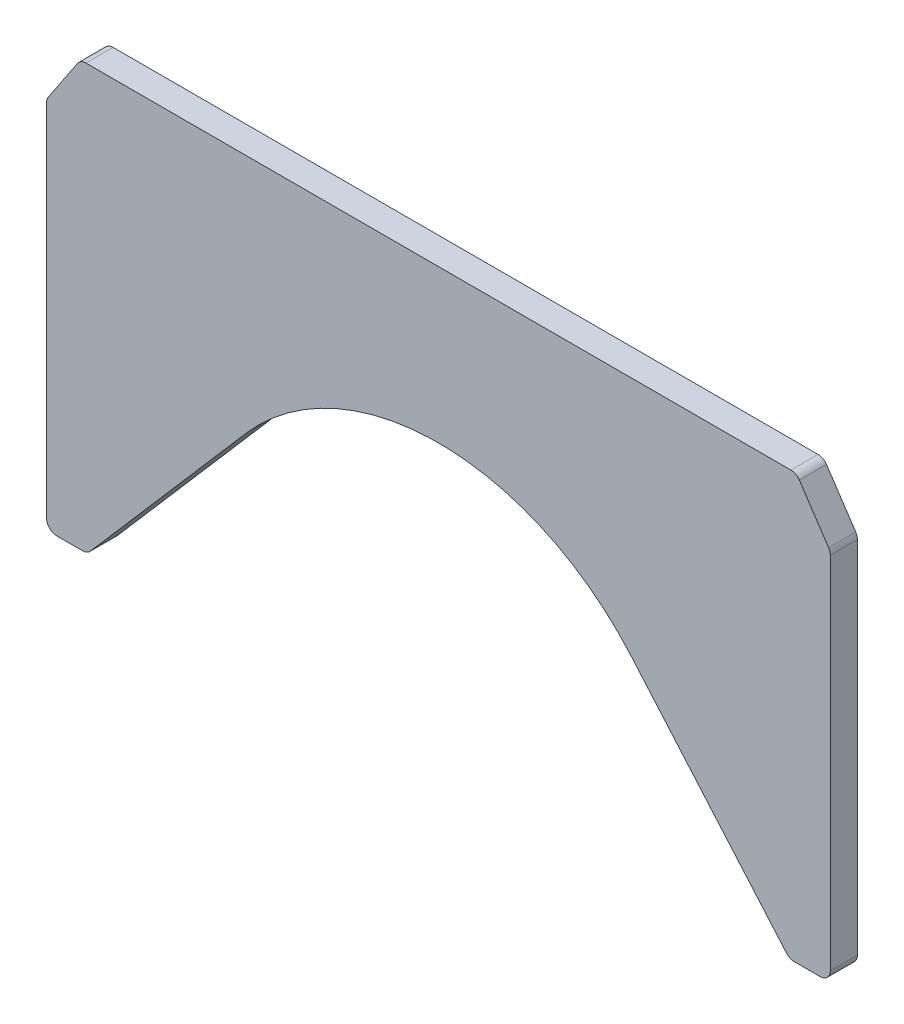
ISO-10303-21;
HEADER;
FILE_DESCRIPTION(('STEP AP214'),'2;1');
FILE_NAME('part.step','',(''),(''),'','','');
FILE_SCHEMA(('AUTOMOTIVE_DESIGN { 1 0 10303 214 1 1 1 1 }'));
ENDSEC;
DATA;
#1=APPLICATION_CONTEXT('core data for automotive mechanical design processes');
#2=APPLICATION_PROTOCOL_DEFINITION('international standard','automotive_design',2000,#1);
#3=PRODUCT_CONTEXT('',#1,'mechanical');
#4=PRODUCT('Part','Part','',(#3));
#5=PRODUCT_RELATED_PRODUCT_CATEGORY('part','',(#4));
#6=PRODUCT_DEFINITION_FORMATION('','',#4);
#7=PRODUCT_DEFINITION_CONTEXT('part definition',#1,'design');
#8=PRODUCT_DEFINITION('design','',#6,#7);
#9=PRODUCT_DEFINITION_SHAPE('','',#8);
#10=(LENGTH_UNIT() NAMED_UNIT(*) SI_UNIT(.MILLI.,.METRE.));
#11=(NAMED_UNIT(*) PLANE_ANGLE_UNIT() SI_UNIT($,.RADIAN.));
#12=(NAMED_UNIT(*) SI_UNIT($,.STERADIAN.) SOLID_ANGLE_UNIT());
#13=UNCERTAINTY_MEASURE_WITH_UNIT(LENGTH_MEASURE(1.E-05),#10,'distance_accuracy_value','');
#14=(GEOMETRIC_REPRESENTATION_CONTEXT(3) GLOBAL_UNCERTAINTY_ASSIGNED_CONTEXT((#13)) GLOBAL_UNIT_ASSIGNED_CONTEXT((#10,
#11,#12)) REPRESENTATION_CONTEXT('',''));
#15=CARTESIAN_POINT('',(0.,0.,0.));
#16=DIRECTION('',(0.,0.,1.));
#17=DIRECTION('',(1.,0.,0.));
#18=AXIS2_PLACEMENT_3D('',#15,#16,#17);
#19=CARTESIAN_POINT('',(2.20931663313005E-13,-120.,7.9999999999999));
#20=DIRECTION('',(0.,0.,-1.));
#21=DIRECTION('',(-1.,0.,0.));
#22=AXIS2_PLACEMENT_3D('',#19,#20,#21);
#23=CYLINDRICAL_SURFACE('',#22,75.);
#24=CARTESIAN_POINT('',(2.21017871854546E-13,-119.999999999999,2.22044604925031E-13));
#25=DIRECTION('',(0.,0.,-1.));
#26=DIRECTION('',(1.,0.,0.));
#27=AXIS2_PLACEMENT_3D('',#24,#25,#26);
#28=CIRCLE('',#27,75.);
#29=CARTESIAN_POINT('',(-56.7184334908846,-70.92842673869,0.));
#30=VERTEX_POINT('',#29);
#31=CARTESIAN_POINT('',(56.7184334908846,-70.9284267386889,1.66533453693773E-13));
#32=VERTEX_POINT('',#31);
#33=EDGE_CURVE('E195',#30,#32,#28,.T.);
#34=ORIENTED_EDGE('',*,*,#33,.T.);
#35=DIRECTION('',(0.,0.,-1.));
#36=VECTOR('',#35,1.);
#37=CARTESIAN_POINT('',(56.7184334908846,-70.9284267386903,8.00000000000034));
#38=LINE('',#37,#36);
#39=CARTESIAN_POINT('',(56.7184334908846,-70.9284267386903,8.00000000000034));
#40=VERTEX_POINT('',#39);
#41=EDGE_CURVE('E11',#40,#32,#38,.T.);
#42=ORIENTED_EDGE('',*,*,#41,.F.);
#43=CARTESIAN_POINT('',(2.20931663313005E-13,-120.,7.9999999999999));
#44=DIRECTION('',(0.,0.,-1.));
#45=DIRECTION('',(1.,0.,0.));
#46=AXIS2_PLACEMENT_3D('',#43,#44,#45);
#47=CIRCLE('',#46,75.);
#48=CARTESIAN_POINT('',(-56.7184334908846,-70.9284267386905,8.00000000000028));
#49=VERTEX_POINT('',#48);
#50=EDGE_CURVE('E229',#49,#40,#47,.T.);
#51=ORIENTED_EDGE('',*,*,#50,.F.);
#52=DIRECTION('',(0.,0.,-1.));
#53=VECTOR('',#52,1.);
#54=CARTESIAN_POINT('',(-56.7184334908846,-70.9284267386905,8.00000000000028));
#55=LINE('',#54,#53);
#56=EDGE_CURVE('E191',#49,#30,#55,.T.);
#57=ORIENTED_EDGE('',*,*,#56,.T.);
#58=EDGE_LOOP('',(#34,#42,#51,#57));
#59=FACE_BOUND('',#58,.T.);
#60=ADVANCED_FACE('F39',(#59),#23,.F.);
#61=CARTESIAN_POINT('',(102.602691231793,-123.962862930452,8.00000000000001));
#62=DIRECTION('',(0.756245779878461,0.654287643484132,0.));
#63=DIRECTION('',(-0.654287643484132,0.756245779878461,0.));
#64=AXIS2_PLACEMENT_3D('',#61,#62,#63);
#65=PLANE('',#64);
#66=DIRECTION('',(0.654287643484132,-0.756245779878461,0.));
#67=VECTOR('',#66,1.);
#68=CARTESIAN_POINT('',(102.602691231793,-123.962862930452,-1.66533453693773E-13));
#69=LINE('',#68,#67);
#70=CARTESIAN_POINT('',(102.602691231793,-123.962862930452,-1.66533453693773E-13));
#71=VERTEX_POINT('',#70);
#72=EDGE_CURVE('E198',#32,#71,#69,.T.);
#73=ORIENTED_EDGE('',*,*,#72,.T.);
#74=DIRECTION('',(0.,0.,-1.));
#75=VECTOR('',#74,1.);
#76=CARTESIAN_POINT('',(102.602691231793,-123.962862930452,8.00000000000001));
#77=LINE('',#76,#75);
#78=CARTESIAN_POINT('',(102.602691231793,-123.962862930452,8.00000000000001));
#79=VERTEX_POINT('',#78);
#80=EDGE_CURVE('E47',#79,#71,#77,.T.);
#81=ORIENTED_EDGE('',*,*,#80,.F.);
#82=DIRECTION('',(0.654287643484132,-0.756245779878461,0.));
#83=VECTOR('',#82,1.);
#84=CARTESIAN_POINT('',(102.602691231793,-123.962862930452,8.00000000000001));
#85=LINE('',#84,#83);
#86=EDGE_CURVE('E128',#40,#79,#85,.T.);
#87=ORIENTED_EDGE('',*,*,#86,.F.);
#88=ORIENTED_EDGE('',*,*,#41,.T.);
#89=EDGE_LOOP('',(#73,#81,#87,#88));
#90=FACE_BOUND('',#89,.T.);
#91=ADVANCED_FACE('F337',(#90),#65,.F.);
#92=CARTESIAN_POINT('',(104.871428571428,-122.,8.00000000000017));
#93=DIRECTION('',(0.,0.,-1.));
#94=DIRECTION('',(-1.,0.,0.));
#95=AXIS2_PLACEMENT_3D('',#92,#93,#94);
#96=CYLINDRICAL_SURFACE('',#95,3.00000000000001);
#97=CARTESIAN_POINT('',(104.871428571428,-122.,0.));
#98=DIRECTION('',(0.,0.,1.));
#99=DIRECTION('',(-1.,0.,0.));
#100=AXIS2_PLACEMENT_3D('',#97,#98,#99);
#101=CIRCLE('',#100,3.00000000000001);
#102=CARTESIAN_POINT('',(104.871428571428,-125.000000000001,0.));
#103=VERTEX_POINT('',#102);
#104=EDGE_CURVE('E200',#71,#103,#101,.T.);
#105=ORIENTED_EDGE('',*,*,#104,.T.);
#106=DIRECTION('',(0.,0.,-1.));
#107=VECTOR('',#106,1.);
#108=CARTESIAN_POINT('',(104.871428571428,-125.,8.00000000000001));
#109=LINE('',#108,#107);
#110=CARTESIAN_POINT('',(104.871428571428,-125.,8.00000000000001));
#111=VERTEX_POINT('',#110);
#112=EDGE_CURVE('E266',#111,#103,#109,.T.);
#113=ORIENTED_EDGE('',*,*,#112,.F.);
#114=CARTESIAN_POINT('',(104.871428571428,-122.,8.00000000000017));
#115=DIRECTION('',(0.,0.,1.));
#116=DIRECTION('',(-1.,0.,0.));
#117=AXIS2_PLACEMENT_3D('',#114,#115,#116);
#118=CIRCLE('',#117,3.00000000000001);
#119=EDGE_CURVE('E274',#79,#111,#118,.T.);
#120=ORIENTED_EDGE('',*,*,#119,.F.);
#121=ORIENTED_EDGE('',*,*,#80,.T.);
#122=EDGE_LOOP('',(#105,#113,#120,#121));
#123=FACE_BOUND('',#122,.T.);
#124=ADVANCED_FACE('F272',(#123),#96,.T.);
#125=CARTESIAN_POINT('',(112.5,-125.,8.00000000000001));
#126=DIRECTION('',(0.,1.,0.));
#127=DIRECTION('',(-1.,0.,0.));
#128=AXIS2_PLACEMENT_3D('',#125,#126,#127);
#129=PLANE('',#128);
#130=DIRECTION('',(1.,0.,0.));
#131=VECTOR('',#130,1.);
#132=CARTESIAN_POINT('',(112.5,-125.,2.22044604925031E-13));
#133=LINE('',#132,#131);
#134=CARTESIAN_POINT('',(112.5,-125.,2.22044604925031E-13));
#135=VERTEX_POINT('',#134);
#136=EDGE_CURVE('E202',#103,#135,#133,.T.);
#137=ORIENTED_EDGE('',*,*,#136,.T.);
#138=DIRECTION('',(0.,0.,-1.));
#139=VECTOR('',#138,1.);
#140=CARTESIAN_POINT('',(112.5,-125.,8.00000000000001));
#141=LINE('',#140,#139);
#142=CARTESIAN_POINT('',(112.5,-125.,8.00000000000001));
#143=VERTEX_POINT('',#142);
#144=EDGE_CURVE('E263',#143,#135,#141,.T.);
#145=ORIENTED_EDGE('',*,*,#144,.F.);
#146=DIRECTION('',(1.,0.,0.));
#147=VECTOR('',#146,1.);
#148=CARTESIAN_POINT('',(112.5,-125.,8.00000000000001));
#149=LINE('',#148,#147);
#150=EDGE_CURVE('E292',#111,#143,#149,.T.);
#151=ORIENTED_EDGE('',*,*,#150,.F.);
#152=ORIENTED_EDGE('',*,*,#112,.T.);
#153=EDGE_LOOP('',(#137,#145,#151,#152));
#154=FACE_BOUND('',#153,.T.);
#155=ADVANCED_FACE('F283',(#154),#129,.F.);
#156=CARTESIAN_POINT('',(112.5,-122.,8.0000000000004));
#157=DIRECTION('',(0.,0.,-1.));
#158=DIRECTION('',(-1.,0.,0.));
#159=AXIS2_PLACEMENT_3D('',#156,#157,#158);
#160=CYLINDRICAL_SURFACE('',#159,2.99999999999999);
#161=CARTESIAN_POINT('',(112.5,-122.,-1.11022302462516E-13));
#162=DIRECTION('',(0.,0.,1.));
#163=DIRECTION('',(-1.,0.,0.));
#164=AXIS2_PLACEMENT_3D('',#161,#162,#163);
#165=CIRCLE('',#164,2.99999999999999);
#166=CARTESIAN_POINT('',(115.5,-122.,0.));
#167=VERTEX_POINT('',#166);
#168=EDGE_CURVE('E204',#135,#167,#165,.T.);
#169=ORIENTED_EDGE('',*,*,#168,.T.);
#170=DIRECTION('',(0.,0.,-1.));
#171=VECTOR('',#170,1.);
#172=CARTESIAN_POINT('',(115.5,-122.,8.0000000000004));
#173=LINE('',#172,#171);
#174=CARTESIAN_POINT('',(115.5,-122.,8.0000000000004));
#175=VERTEX_POINT('',#174);
#176=EDGE_CURVE('E260',#175,#167,#173,.T.);
#177=ORIENTED_EDGE('',*,*,#176,.F.);
#178=CARTESIAN_POINT('',(112.5,-122.,8.0000000000004));
#179=DIRECTION('',(0.,0.,1.));
#180=DIRECTION('',(-1.,0.,0.));
#181=AXIS2_PLACEMENT_3D('',#178,#179,#180);
#182=CIRCLE('',#181,2.99999999999999);
#183=EDGE_CURVE('E289',#143,#175,#182,.T.);
#184=ORIENTED_EDGE('',*,*,#183,.F.);
#185=ORIENTED_EDGE('',*,*,#144,.T.);
#186=EDGE_LOOP('',(#169,#177,#184,#185));
#187=FACE_BOUND('',#186,.T.);
#188=ADVANCED_FACE('F287',(#187),#160,.T.);
#189=CARTESIAN_POINT('',(115.5,-15.908326913195,8.00000000000034));
#190=DIRECTION('',(-1.,0.,0.));
#191=DIRECTION('',(0.,-1.,0.));
#192=AXIS2_PLACEMENT_3D('',#189,#190,#191);
#193=PLANE('',#192);
#194=DIRECTION('',(0.,1.,0.));
#195=VECTOR('',#194,1.);
#196=CARTESIAN_POINT('',(115.5,-15.9083269131961,0.));
#197=LINE('',#196,#195);
#198=CARTESIAN_POINT('',(115.5,-15.9083269131961,0.));
#199=VERTEX_POINT('',#198);
#200=EDGE_CURVE('E206',#167,#199,#197,.T.);
#201=ORIENTED_EDGE('',*,*,#200,.T.);
#202=DIRECTION('',(0.,0.,-1.));
#203=VECTOR('',#202,1.);
#204=CARTESIAN_POINT('',(115.5,-15.908326913195,8.00000000000034));
#205=LINE('',#204,#203);
#206=CARTESIAN_POINT('',(115.5,-15.908326913195,8.00000000000034));
#207=VERTEX_POINT('',#206);
#208=EDGE_CURVE('E257',#207,#199,#205,.T.);
#209=ORIENTED_EDGE('',*,*,#208,.F.);
#210=DIRECTION('',(0.,1.,0.));
#211=VECTOR('',#210,1.);
#212=CARTESIAN_POINT('',(115.5,-15.908326913195,8.00000000000034));
#213=LINE('',#212,#211);
#214=EDGE_CURVE('E291',#175,#207,#213,.T.);
#215=ORIENTED_EDGE('',*,*,#214,.F.);
#216=ORIENTED_EDGE('',*,*,#176,.T.);
#217=EDGE_LOOP('',(#201,#209,#215,#216));
#218=FACE_BOUND('',#217,.T.);
#219=ADVANCED_FACE('F350',(#218),#193,.F.);
#220=CARTESIAN_POINT('',(112.5,-15.9083269131957,8.00000000000023));
#221=DIRECTION('',(0.,0.,-1.));
#222=DIRECTION('',(-1.,0.,0.));
#223=AXIS2_PLACEMENT_3D('',#220,#221,#222);
#224=CYLINDRICAL_SURFACE('',#223,3.00000000000001);
#225=CARTESIAN_POINT('',(112.5,-15.9083269131961,2.22044604925031E-13));
#226=DIRECTION('',(0.,0.,1.));
#227=DIRECTION('',(-1.,0.,0.));
#228=AXIS2_PLACEMENT_3D('',#225,#226,#227);
#229=CIRCLE('',#228,3.00000000000001);
#230=CARTESIAN_POINT('',(114.996150883013,-14.2442263245204,0.));
#231=VERTEX_POINT('',#230);
#232=EDGE_CURVE('E208',#199,#231,#229,.T.);
#233=ORIENTED_EDGE('',*,*,#232,.T.);
#234=DIRECTION('',(0.,0.,-1.));
#235=VECTOR('',#234,1.);
#236=CARTESIAN_POINT('',(114.996150883013,-14.2442263245197,8.0000000000004));
#237=LINE('',#236,#235);
#238=CARTESIAN_POINT('',(114.996150883013,-14.2442263245197,8.0000000000004));
#239=VERTEX_POINT('',#238);
#240=EDGE_CURVE('E254',#239,#231,#237,.T.);
#241=ORIENTED_EDGE('',*,*,#240,.F.);
#242=CARTESIAN_POINT('',(112.5,-15.9083269131957,8.00000000000023));
#243=DIRECTION('',(0.,0.,1.));
#244=DIRECTION('',(-1.,0.,0.));
#245=AXIS2_PLACEMENT_3D('',#242,#243,#244);
#246=CIRCLE('',#245,3.00000000000001);
#247=EDGE_CURVE('E294',#207,#239,#246,.T.);
#248=ORIENTED_EDGE('',*,*,#247,.F.);
#249=ORIENTED_EDGE('',*,*,#208,.T.);
#250=EDGE_LOOP('',(#233,#241,#248,#249));
#251=FACE_BOUND('',#250,.T.);
#252=ADVANCED_FACE('F353',(#251),#224,.T.);
#253=CARTESIAN_POINT('',(106.39059960755,-1.33589941132328,8.00000000000023));
#254=DIRECTION('',(-0.832050294337845,-0.554700196225227,0.));
#255=DIRECTION('',(0.554700196225227,-0.832050294337845,0.));
#256=AXIS2_PLACEMENT_3D('',#253,#254,#255);
#257=PLANE('',#256);
#258=DIRECTION('',(-0.554700196225227,0.832050294337845,0.));
#259=VECTOR('',#258,1.);
#260=CARTESIAN_POINT('',(106.39059960755,-1.33589941132439,1.11022302462516E-13));
#261=LINE('',#260,#259);
#262=CARTESIAN_POINT('',(106.39059960755,-1.33589941132439,1.11022302462516E-13));
#263=VERTEX_POINT('',#262);
#264=EDGE_CURVE('E210',#231,#263,#261,.T.);
#265=ORIENTED_EDGE('',*,*,#264,.T.);
#266=DIRECTION('',(0.,0.,-1.));
#267=VECTOR('',#266,1.);
#268=CARTESIAN_POINT('',(106.39059960755,-1.33589941132328,8.00000000000023));
#269=LINE('',#268,#267);
#270=CARTESIAN_POINT('',(106.39059960755,-1.33589941132328,8.00000000000023));
#271=VERTEX_POINT('',#270);
#272=EDGE_CURVE('E251',#271,#263,#269,.T.);
#273=ORIENTED_EDGE('',*,*,#272,.F.);
#274=DIRECTION('',(-0.554700196225227,0.832050294337845,0.));
#275=VECTOR('',#274,1.);
#276=CARTESIAN_POINT('',(106.39059960755,-1.33589941132328,8.00000000000023));
#277=LINE('',#276,#275);
#278=EDGE_CURVE('E300',#239,#271,#277,.T.);
#279=ORIENTED_EDGE('',*,*,#278,.F.);
#280=ORIENTED_EDGE('',*,*,#240,.T.);
#281=EDGE_LOOP('',(#265,#273,#279,#280));
#282=FACE_BOUND('',#281,.T.);
#283=ADVANCED_FACE('F357',(#282),#257,.F.);
#284=CARTESIAN_POINT('',(103.894448724536,-2.99999999999989,8.00000000000001));
#285=DIRECTION('',(0.,0.,-1.));
#286=DIRECTION('',(-1.,0.,0.));
#287=AXIS2_PLACEMENT_3D('',#284,#285,#286);
#288=CYLINDRICAL_SURFACE('',#287,3.00000000000001);
#289=CARTESIAN_POINT('',(103.894448724536,-3.00000000000011,0.));
#290=DIRECTION('',(0.,0.,1.));
#291=DIRECTION('',(-1.,0.,0.));
#292=AXIS2_PLACEMENT_3D('',#289,#290,#291);
#293=CIRCLE('',#292,3.00000000000001);
#294=CARTESIAN_POINT('',(103.894448724536,2.22044604925031E-13,2.77555756156289E-13));
#295=VERTEX_POINT('',#294);
#296=EDGE_CURVE('E212',#263,#295,#293,.T.);
#297=ORIENTED_EDGE('',*,*,#296,.T.);
#298=DIRECTION('',(0.,0.,-1.));
#299=VECTOR('',#298,1.);
#300=CARTESIAN_POINT('',(103.894448724536,0.,8.00000000000001));
#301=LINE('',#300,#299);
#302=CARTESIAN_POINT('',(103.894448724536,0.,8.00000000000001));
#303=VERTEX_POINT('',#302);
#304=EDGE_CURVE('E248',#303,#295,#301,.T.);
#305=ORIENTED_EDGE('',*,*,#304,.F.);
#306=CARTESIAN_POINT('',(103.894448724536,-2.99999999999989,8.00000000000001));
#307=DIRECTION('',(0.,0.,1.));
#308=DIRECTION('',(-1.,0.,0.));
#309=AXIS2_PLACEMENT_3D('',#306,#307,#308);
#310=CIRCLE('',#309,3.00000000000001);
#311=EDGE_CURVE('E302',#271,#303,#310,.T.);
#312=ORIENTED_EDGE('',*,*,#311,.F.);
#313=ORIENTED_EDGE('',*,*,#272,.T.);
#314=EDGE_LOOP('',(#297,#305,#312,#313));
#315=FACE_BOUND('',#314,.T.);
#316=ADVANCED_FACE('F361',(#315),#288,.T.);
#317=CARTESIAN_POINT('',(-103.894448724536,0.,8.00000000000028));
#318=DIRECTION('',(0.,-1.,0.));
#319=DIRECTION('',(1.,0.,0.));
#320=AXIS2_PLACEMENT_3D('',#317,#318,#319);
#321=PLANE('',#320);
#322=DIRECTION('',(-1.,0.,0.));
#323=VECTOR('',#322,1.);
#324=CARTESIAN_POINT('',(-103.894448724536,0.,2.22044604925031E-13));
#325=LINE('',#324,#323);
#326=CARTESIAN_POINT('',(-103.894448724536,0.,2.22044604925031E-13));
#327=VERTEX_POINT('',#326);
#328=EDGE_CURVE('E214',#295,#327,#325,.T.);
#329=ORIENTED_EDGE('',*,*,#328,.T.);
#330=DIRECTION('',(0.,0.,-1.));
#331=VECTOR('',#330,1.);
#332=CARTESIAN_POINT('',(-103.894448724536,0.,8.00000000000028));
#333=LINE('',#332,#331);
#334=CARTESIAN_POINT('',(-103.894448724536,0.,8.00000000000028));
#335=VERTEX_POINT('',#334);
#336=EDGE_CURVE('E245',#335,#327,#333,.T.);
#337=ORIENTED_EDGE('',*,*,#336,.F.);
#338=DIRECTION('',(-1.,0.,0.));
#339=VECTOR('',#338,1.);
#340=CARTESIAN_POINT('',(-103.894448724536,0.,8.00000000000028));
#341=LINE('',#340,#339);
#342=EDGE_CURVE('E304',#303,#335,#341,.T.);
#343=ORIENTED_EDGE('',*,*,#342,.F.);
#344=ORIENTED_EDGE('',*,*,#304,.T.);
#345=EDGE_LOOP('',(#329,#337,#343,#344));
#346=FACE_BOUND('',#345,.T.);
#347=ADVANCED_FACE('F365',(#346),#321,.F.);
#348=CARTESIAN_POINT('',(-103.894448724536,-2.99999999999989,8.00000000000023));
#349=DIRECTION('',(0.,0.,-1.));
#350=DIRECTION('',(-1.,0.,0.));
#351=AXIS2_PLACEMENT_3D('',#348,#349,#350);
#352=CYLINDRICAL_SURFACE('',#351,3.00000000000001);
#353=CARTESIAN_POINT('',(-103.894448724536,-3.000000000001,-2.22044604925031E-13));
#354=DIRECTION('',(0.,0.,1.));
#355=DIRECTION('',(-1.,0.,0.));
#356=AXIS2_PLACEMENT_3D('',#353,#354,#355);
#357=CIRCLE('',#356,3.00000000000001);
#358=CARTESIAN_POINT('',(-106.39059960755,-1.33589941132439,1.11022302462516E-13));
#359=VERTEX_POINT('',#358);
#360=EDGE_CURVE('E216',#327,#359,#357,.T.);
#361=ORIENTED_EDGE('',*,*,#360,.T.);
#362=DIRECTION('',(0.,0.,-1.));
#363=VECTOR('',#362,1.);
#364=CARTESIAN_POINT('',(-106.39059960755,-1.33589941132417,7.99999999999984));
#365=LINE('',#364,#363);
#366=CARTESIAN_POINT('',(-106.39059960755,-1.33589941132417,7.99999999999984));
#367=VERTEX_POINT('',#366);
#368=EDGE_CURVE('E242',#367,#359,#365,.T.);
#369=ORIENTED_EDGE('',*,*,#368,.F.);
#370=CARTESIAN_POINT('',(-103.894448724536,-2.99999999999989,8.00000000000023));
#371=DIRECTION('',(0.,0.,1.));
#372=DIRECTION('',(-1.,0.,0.));
#373=AXIS2_PLACEMENT_3D('',#370,#371,#372);
#374=CIRCLE('',#373,3.00000000000001);
#375=EDGE_CURVE('E306',#335,#367,#374,.T.);
#376=ORIENTED_EDGE('',*,*,#375,.F.);
#377=ORIENTED_EDGE('',*,*,#336,.T.);
#378=EDGE_LOOP('',(#361,#369,#376,#377));
#379=FACE_BOUND('',#378,.T.);
#380=ADVANCED_FACE('F369',(#379),#352,.T.);
#381=CARTESIAN_POINT('',(-106.39059960755,-1.33589941132417,7.99999999999984));
#382=DIRECTION('',(0.832050294337845,-0.554700196225227,0.));
#383=DIRECTION('',(0.554700196225227,0.832050294337845,0.));
#384=AXIS2_PLACEMENT_3D('',#381,#382,#383);
#385=PLANE('',#384);
#386=DIRECTION('',(-0.554700196225227,-0.832050294337845,0.));
#387=VECTOR('',#386,1.);
#388=CARTESIAN_POINT('',(-106.39059960755,-1.33589941132439,1.11022302462516E-13));
#389=LINE('',#388,#387);
#390=CARTESIAN_POINT('',(-114.996150883014,-14.2442263245204,2.22044604925031E-13));
#391=VERTEX_POINT('',#390);
#392=EDGE_CURVE('E218',#359,#391,#389,.T.);
#393=ORIENTED_EDGE('',*,*,#392,.T.);
#394=DIRECTION('',(0.,0.,-1.));
#395=VECTOR('',#394,1.);
#396=CARTESIAN_POINT('',(-114.996150883014,-14.2442263245197,8.0000000000004));
#397=LINE('',#396,#395);
#398=CARTESIAN_POINT('',(-114.996150883014,-14.2442263245197,8.0000000000004));
#399=VERTEX_POINT('',#398);
#400=EDGE_CURVE('E239',#399,#391,#397,.T.);
#401=ORIENTED_EDGE('',*,*,#400,.F.);
#402=DIRECTION('',(-0.554700196225227,-0.832050294337845,0.));
#403=VECTOR('',#402,1.);
#404=CARTESIAN_POINT('',(-106.39059960755,-1.33589941132417,7.99999999999984));
#405=LINE('',#404,#403);
#406=EDGE_CURVE('E308',#367,#399,#405,.T.);
#407=ORIENTED_EDGE('',*,*,#406,.F.);
#408=ORIENTED_EDGE('',*,*,#368,.T.);
#409=EDGE_LOOP('',(#393,#401,#407,#408));
#410=FACE_BOUND('',#409,.T.);
#411=ADVANCED_FACE('F373',(#410),#385,.F.);
#412=CARTESIAN_POINT('',(-112.5,-15.9083269131952,8.00000000000028));
#413=DIRECTION('',(0.,0.,-1.));
#414=DIRECTION('',(-1.,0.,0.));
#415=AXIS2_PLACEMENT_3D('',#412,#413,#414);
#416=CYLINDRICAL_SURFACE('',#415,3.00000000000001);
#417=CARTESIAN_POINT('',(-112.5,-15.9083269131961,0.));
#418=DIRECTION('',(0.,0.,1.));
#419=DIRECTION('',(-1.,0.,0.));
#420=AXIS2_PLACEMENT_3D('',#417,#418,#419);
#421=CIRCLE('',#420,3.00000000000001);
#422=CARTESIAN_POINT('',(-115.5,-15.9083269131961,0.));
#423=VERTEX_POINT('',#422);
#424=EDGE_CURVE('E220',#391,#423,#421,.T.);
#425=ORIENTED_EDGE('',*,*,#424,.T.);
#426=DIRECTION('',(0.,0.,-1.));
#427=VECTOR('',#426,1.);
#428=CARTESIAN_POINT('',(-115.5,-15.9083269131954,8.00000000000028));
#429=LINE('',#428,#427);
#430=CARTESIAN_POINT('',(-115.5,-15.9083269131954,8.00000000000028));
#431=VERTEX_POINT('',#430);
#432=EDGE_CURVE('E236',#431,#423,#429,.T.);
#433=ORIENTED_EDGE('',*,*,#432,.F.);
#434=CARTESIAN_POINT('',(-112.5,-15.9083269131952,8.00000000000028));
#435=DIRECTION('',(0.,0.,1.));
#436=DIRECTION('',(-1.,0.,0.));
#437=AXIS2_PLACEMENT_3D('',#434,#435,#436);
#438=CIRCLE('',#437,3.00000000000001);
#439=EDGE_CURVE('E310',#399,#431,#438,.T.);
#440=ORIENTED_EDGE('',*,*,#439,.F.);
#441=ORIENTED_EDGE('',*,*,#400,.T.);
#442=EDGE_LOOP('',(#425,#433,#440,#441));
#443=FACE_BOUND('',#442,.T.);
#444=ADVANCED_FACE('F377',(#443),#416,.T.);
#445=CARTESIAN_POINT('',(-115.5,-15.9083269131954,8.00000000000028));
#446=DIRECTION('',(1.,0.,0.));
#447=DIRECTION('',(0.,1.,0.));
#448=AXIS2_PLACEMENT_3D('',#445,#446,#447);
#449=PLANE('',#448);
#450=DIRECTION('',(0.,-1.,0.));
#451=VECTOR('',#450,1.);
#452=CARTESIAN_POINT('',(-115.5,-15.9083269131961,0.));
#453=LINE('',#452,#451);
#454=CARTESIAN_POINT('',(-115.5,-122.000000000001,0.));
#455=VERTEX_POINT('',#454);
#456=EDGE_CURVE('E222',#423,#455,#453,.T.);
#457=ORIENTED_EDGE('',*,*,#456,.T.);
#458=DIRECTION('',(0.,0.,-1.));
#459=VECTOR('',#458,1.);
#460=CARTESIAN_POINT('',(-115.5,-122.,8.00000000000017));
#461=LINE('',#460,#459);
#462=CARTESIAN_POINT('',(-115.5,-122.,8.00000000000017));
#463=VERTEX_POINT('',#462);
#464=EDGE_CURVE('E233',#463,#455,#461,.T.);
#465=ORIENTED_EDGE('',*,*,#464,.F.);
#466=DIRECTION('',(0.,-1.,0.));
#467=VECTOR('',#466,1.);
#468=CARTESIAN_POINT('',(-115.5,-15.9083269131954,8.00000000000028));
#469=LINE('',#468,#467);
#470=EDGE_CURVE('E312',#431,#463,#469,.T.);
#471=ORIENTED_EDGE('',*,*,#470,.F.);
#472=ORIENTED_EDGE('',*,*,#432,.T.);
#473=EDGE_LOOP('',(#457,#465,#471,#472));
#474=FACE_BOUND('',#473,.T.);
#475=ADVANCED_FACE('F318',(#474),#449,.F.);
#476=CARTESIAN_POINT('',(-112.5,-122.,8.00000000000028));
#477=DIRECTION('',(0.,0.,-1.));
#478=DIRECTION('',(-1.,0.,0.));
#479=AXIS2_PLACEMENT_3D('',#476,#477,#478);
#480=CYLINDRICAL_SURFACE('',#479,2.99999999999999);
#481=CARTESIAN_POINT('',(-112.5,-122.,0.));
#482=DIRECTION('',(0.,0.,1.));
#483=DIRECTION('',(-1.,0.,0.));
#484=AXIS2_PLACEMENT_3D('',#481,#482,#483);
#485=CIRCLE('',#484,2.99999999999999);
#486=CARTESIAN_POINT('',(-112.5,-125.000000000001,0.));
#487=VERTEX_POINT('',#486);
#488=EDGE_CURVE('E224',#455,#487,#485,.T.);
#489=ORIENTED_EDGE('',*,*,#488,.T.);
#490=DIRECTION('',(0.,0.,-1.));
#491=VECTOR('',#490,1.);
#492=CARTESIAN_POINT('',(-112.5,-125.,7.99999999999979));
#493=LINE('',#492,#491);
#494=CARTESIAN_POINT('',(-112.5,-125.,7.99999999999979));
#495=VERTEX_POINT('',#494);
#496=EDGE_CURVE('E186',#495,#487,#493,.T.);
#497=ORIENTED_EDGE('',*,*,#496,.F.);
#498=CARTESIAN_POINT('',(-112.5,-122.,8.00000000000028));
#499=DIRECTION('',(0.,0.,1.));
#500=DIRECTION('',(-1.,0.,0.));
#501=AXIS2_PLACEMENT_3D('',#498,#499,#500);
#502=CIRCLE('',#501,2.99999999999999);
#503=EDGE_CURVE('E177',#463,#495,#502,.T.);
#504=ORIENTED_EDGE('',*,*,#503,.F.);
#505=ORIENTED_EDGE('',*,*,#464,.T.);
#506=EDGE_LOOP('',(#489,#497,#504,#505));
#507=FACE_BOUND('',#506,.T.);
#508=ADVANCED_FACE('F322',(#507),#480,.T.);
#509=CARTESIAN_POINT('',(-112.5,-125.,7.99999999999979));
#510=DIRECTION('',(0.,1.,0.));
#511=DIRECTION('',(-1.,0.,0.));
#512=AXIS2_PLACEMENT_3D('',#509,#510,#511);
#513=PLANE('',#512);
#514=DIRECTION('',(1.,0.,0.));
#515=VECTOR('',#514,1.);
#516=CARTESIAN_POINT('',(-112.5,-125.000000000001,0.));
#517=LINE('',#516,#515);
#518=CARTESIAN_POINT('',(-104.871428571429,-125.000000000001,-2.77555756156289E-13));
#519=VERTEX_POINT('',#518);
#520=EDGE_CURVE('E185',#487,#519,#517,.T.);
#521=ORIENTED_EDGE('',*,*,#520,.T.);
#522=DIRECTION('',(0.,0.,-1.));
#523=VECTOR('',#522,1.);
#524=CARTESIAN_POINT('',(-104.871428571429,-125.,7.99999999999979));
#525=LINE('',#524,#523);
#526=CARTESIAN_POINT('',(-104.871428571429,-125.,7.99999999999979));
#527=VERTEX_POINT('',#526);
#528=EDGE_CURVE('E182',#527,#519,#525,.T.);
#529=ORIENTED_EDGE('',*,*,#528,.F.);
#530=DIRECTION('',(1.,0.,0.));
#531=VECTOR('',#530,1.);
#532=CARTESIAN_POINT('',(-112.5,-125.,7.99999999999979));
#533=LINE('',#532,#531);
#534=EDGE_CURVE('E171',#495,#527,#533,.T.);
#535=ORIENTED_EDGE('',*,*,#534,.F.);
#536=ORIENTED_EDGE('',*,*,#496,.T.);
#537=EDGE_LOOP('',(#521,#529,#535,#536));
#538=FACE_BOUND('',#537,.T.);
#539=ADVANCED_FACE('F183',(#538),#513,.F.);
#540=CARTESIAN_POINT('',(-104.871428571429,-122.,8.00000000000028));
#541=DIRECTION('',(0.,0.,-1.));
#542=DIRECTION('',(-1.,0.,0.));
#543=AXIS2_PLACEMENT_3D('',#540,#541,#542);
#544=CYLINDRICAL_SURFACE('',#543,3.00000000000001);
#545=CARTESIAN_POINT('',(-104.871428571429,-122.000000000001,1.11022302462516E-13));
#546=DIRECTION('',(0.,0.,1.));
#547=DIRECTION('',(-1.,0.,0.));
#548=AXIS2_PLACEMENT_3D('',#545,#546,#547);
#549=CIRCLE('',#548,3.00000000000001);
#550=CARTESIAN_POINT('',(-102.602691231793,-123.962862930452,-1.11022302462516E-13));
#551=VERTEX_POINT('',#550);
#552=EDGE_CURVE('E114',#519,#551,#549,.T.);
#553=ORIENTED_EDGE('',*,*,#552,.T.);
#554=DIRECTION('',(0.,0.,-1.));
#555=VECTOR('',#554,1.);
#556=CARTESIAN_POINT('',(-102.602691231793,-123.962862930453,7.99999999999995));
#557=LINE('',#556,#555);
#558=CARTESIAN_POINT('',(-102.602691231793,-123.962862930453,7.99999999999995));
#559=VERTEX_POINT('',#558);
#560=EDGE_CURVE('E187',#559,#551,#557,.T.);
#561=ORIENTED_EDGE('',*,*,#560,.F.);
#562=CARTESIAN_POINT('',(-104.871428571429,-122.,8.00000000000028));
#563=DIRECTION('',(0.,0.,1.));
#564=DIRECTION('',(-1.,0.,0.));
#565=AXIS2_PLACEMENT_3D('',#562,#563,#564);
#566=CIRCLE('',#565,3.00000000000001);
#567=EDGE_CURVE('E175',#527,#559,#566,.T.);
#568=ORIENTED_EDGE('',*,*,#567,.F.);
#569=ORIENTED_EDGE('',*,*,#528,.T.);
#570=EDGE_LOOP('',(#553,#561,#568,#569));
#571=FACE_BOUND('',#570,.T.);
#572=ADVANCED_FACE('F189',(#571),#544,.T.);
#573=CARTESIAN_POINT('',(-102.602691231793,-123.962862930453,7.99999999999995));
#574=DIRECTION('',(-0.756245779878461,0.654287643484131,0.));
#575=DIRECTION('',(-0.654287643484132,-0.756245779878461,0.));
#576=AXIS2_PLACEMENT_3D('',#573,#574,#575);
#577=PLANE('',#576);
#578=DIRECTION('',(0.654287643484132,0.756245779878461,0.));
#579=VECTOR('',#578,1.);
#580=CARTESIAN_POINT('',(-102.602691231793,-123.962862930452,-1.11022302462516E-13));
#581=LINE('',#580,#579);
#582=EDGE_CURVE('E120',#551,#30,#581,.T.);
#583=ORIENTED_EDGE('',*,*,#582,.T.);
#584=ORIENTED_EDGE('',*,*,#56,.F.);
#585=DIRECTION('',(0.654287643484132,0.756245779878461,0.));
#586=VECTOR('',#585,1.);
#587=CARTESIAN_POINT('',(-102.602691231793,-123.962862930453,7.99999999999995));
#588=LINE('',#587,#586);
#589=EDGE_CURVE('E55',#559,#49,#588,.T.);
#590=ORIENTED_EDGE('',*,*,#589,.F.);
#591=ORIENTED_EDGE('',*,*,#560,.T.);
#592=EDGE_LOOP('',(#583,#584,#590,#591));
#593=FACE_BOUND('',#592,.T.);
#594=ADVANCED_FACE('F326',(#593),#577,.F.);
#595=CARTESIAN_POINT('',(2.20931663313005E-13,-120.,7.9999999999999));
#596=DIRECTION('',(0.,0.,1.));
#597=DIRECTION('',(1.,0.,0.));
#598=AXIS2_PLACEMENT_3D('',#595,#596,#597);
#599=PLANE('',#598);
#600=ORIENTED_EDGE('',*,*,#50,.T.);
#601=ORIENTED_EDGE('',*,*,#86,.T.);
#602=ORIENTED_EDGE('',*,*,#119,.T.);
#603=ORIENTED_EDGE('',*,*,#150,.T.);
#604=ORIENTED_EDGE('',*,*,#183,.T.);
#605=ORIENTED_EDGE('',*,*,#214,.T.);
#606=ORIENTED_EDGE('',*,*,#247,.T.);
#607=ORIENTED_EDGE('',*,*,#278,.T.);
#608=ORIENTED_EDGE('',*,*,#311,.T.);
#609=ORIENTED_EDGE('',*,*,#342,.T.);
#610=ORIENTED_EDGE('',*,*,#375,.T.);
#611=ORIENTED_EDGE('',*,*,#406,.T.);
#612=ORIENTED_EDGE('',*,*,#439,.T.);
#613=ORIENTED_EDGE('',*,*,#470,.T.);
#614=ORIENTED_EDGE('',*,*,#503,.T.);
#615=ORIENTED_EDGE('',*,*,#534,.T.);
#616=ORIENTED_EDGE('',*,*,#567,.T.);
#617=ORIENTED_EDGE('',*,*,#589,.T.);
#618=EDGE_LOOP('',(#600,#601,#602,#603,#604,#605,#606,#607,#608,#609,#610,#611,#612,#613,#614,
#615,#616,#617));
#619=FACE_BOUND('',#618,.T.);
#620=ADVANCED_FACE('F173',(#619),#599,.T.);
#621=CARTESIAN_POINT('',(2.21017871854546E-13,-119.999999999999,2.22044604925031E-13));
#622=DIRECTION('',(0.,0.,1.));
#623=DIRECTION('',(1.,0.,0.));
#624=AXIS2_PLACEMENT_3D('',#621,#622,#623);
#625=PLANE('',#624);
#626=ORIENTED_EDGE('',*,*,#33,.F.);
#627=ORIENTED_EDGE('',*,*,#582,.F.);
#628=ORIENTED_EDGE('',*,*,#552,.F.);
#629=ORIENTED_EDGE('',*,*,#520,.F.);
#630=ORIENTED_EDGE('',*,*,#488,.F.);
#631=ORIENTED_EDGE('',*,*,#456,.F.);
#632=ORIENTED_EDGE('',*,*,#424,.F.);
#633=ORIENTED_EDGE('',*,*,#392,.F.);
#634=ORIENTED_EDGE('',*,*,#360,.F.);
#635=ORIENTED_EDGE('',*,*,#328,.F.);
#636=ORIENTED_EDGE('',*,*,#296,.F.);
#637=ORIENTED_EDGE('',*,*,#264,.F.);
#638=ORIENTED_EDGE('',*,*,#232,.F.);
#639=ORIENTED_EDGE('',*,*,#200,.F.);
#640=ORIENTED_EDGE('',*,*,#168,.F.);
#641=ORIENTED_EDGE('',*,*,#136,.F.);
#642=ORIENTED_EDGE('',*,*,#104,.F.);
#643=ORIENTED_EDGE('',*,*,#72,.F.);
#644=EDGE_LOOP('',(#626,#627,#628,#629,#630,#631,#632,#633,#634,#635,#636,#637,#638,#639,#640,
#641,#642,#643));
#645=FACE_BOUND('',#644,.T.);
#646=ADVANCED_FACE('F278',(#645),#625,.F.);
#647=CLOSED_SHELL('',(#60,#91,#124,#155,#188,#219,#252,#283,#316,#347,#380,#411,#444,#475,#508,
#539,#572,#594,#620,#646));
#648=MANIFOLD_SOLID_BREP('B2',#647);
#649=ADVANCED_BREP_SHAPE_REPRESENTATION('',(#18,#648),#14);
#650=SHAPE_DEFINITION_REPRESENTATION(#9,#649);
ENDSEC;
END-ISO-10303-21;
